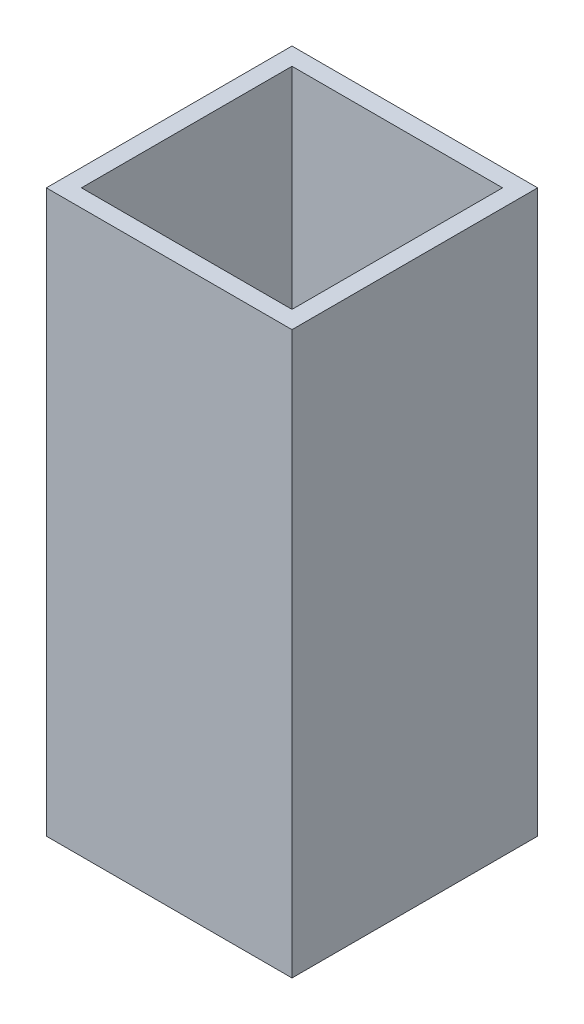
ISO-10303-21;
HEADER;
FILE_DESCRIPTION(('STEP AP214'),'2;1');
FILE_NAME('part.step','',(''),(''),'','','');
FILE_SCHEMA(('AUTOMOTIVE_DESIGN { 1 0 10303 214 1 1 1 1 }'));
ENDSEC;
DATA;
#1=APPLICATION_CONTEXT('core data for automotive mechanical design processes');
#2=APPLICATION_PROTOCOL_DEFINITION('international standard','automotive_design',2000,#1);
#3=PRODUCT_CONTEXT('',#1,'mechanical');
#4=PRODUCT('Part','Part','',(#3));
#5=PRODUCT_RELATED_PRODUCT_CATEGORY('part','',(#4));
#6=PRODUCT_DEFINITION_FORMATION('','',#4);
#7=PRODUCT_DEFINITION_CONTEXT('part definition',#1,'design');
#8=PRODUCT_DEFINITION('design','',#6,#7);
#9=PRODUCT_DEFINITION_SHAPE('','',#8);
#10=(LENGTH_UNIT() NAMED_UNIT(*) SI_UNIT(.MILLI.,.METRE.));
#11=(NAMED_UNIT(*) PLANE_ANGLE_UNIT() SI_UNIT($,.RADIAN.));
#12=(NAMED_UNIT(*) SI_UNIT($,.STERADIAN.) SOLID_ANGLE_UNIT());
#13=UNCERTAINTY_MEASURE_WITH_UNIT(LENGTH_MEASURE(1.E-05),#10,'distance_accuracy_value','');
#14=(GEOMETRIC_REPRESENTATION_CONTEXT(3) GLOBAL_UNCERTAINTY_ASSIGNED_CONTEXT((#13)) GLOBAL_UNIT_ASSIGNED_CONTEXT((#10,
#11,#12)) REPRESENTATION_CONTEXT('',''));
#15=CARTESIAN_POINT('',(0.,0.,0.));
#16=DIRECTION('',(0.,0.,1.));
#17=DIRECTION('',(1.,0.,0.));
#18=AXIS2_PLACEMENT_3D('',#15,#16,#17);
#19=CARTESIAN_POINT('',(0.,101.6,41.275));
#20=DIRECTION('',(0.,0.,1.));
#21=DIRECTION('',(1.,0.,0.));
#22=AXIS2_PLACEMENT_3D('',#19,#20,#21);
#23=PLANE('',#22);
#24=DIRECTION('',(0.,1.,0.));
#25=VECTOR('',#24,1.);
#26=CARTESIAN_POINT('',(663.575,101.6,41.275));
#27=LINE('',#26,#25);
#28=CARTESIAN_POINT('',(663.575,101.6,41.275));
#29=VERTEX_POINT('',#28);
#30=CARTESIAN_POINT('',(663.575,0.,41.275));
#31=VERTEX_POINT('',#30);
#32=EDGE_CURVE('E17',#29,#31,#27,.F.);
#33=ORIENTED_EDGE('',*,*,#32,.F.);
#34=DIRECTION('',(1.,0.,0.));
#35=VECTOR('',#34,1.);
#36=CARTESIAN_POINT('',(0.,101.6,41.275));
#37=LINE('',#36,#35);
#38=CARTESIAN_POINT('',(701.675,101.6,41.275));
#39=VERTEX_POINT('',#38);
#40=EDGE_CURVE('E103',#39,#29,#37,.F.);
#41=ORIENTED_EDGE('',*,*,#40,.F.);
#42=DIRECTION('',(0.,1.,0.));
#43=VECTOR('',#42,1.);
#44=CARTESIAN_POINT('',(701.675,101.6,41.275));
#45=LINE('',#44,#43);
#46=CARTESIAN_POINT('',(701.675,0.,41.275));
#47=VERTEX_POINT('',#46);
#48=EDGE_CURVE('E99',#47,#39,#45,.T.);
#49=ORIENTED_EDGE('',*,*,#48,.F.);
#50=DIRECTION('',(1.,0.,0.));
#51=VECTOR('',#50,1.);
#52=CARTESIAN_POINT('',(0.,0.,41.275));
#53=LINE('',#52,#51);
#54=EDGE_CURVE('E117',#47,#31,#53,.F.);
#55=ORIENTED_EDGE('',*,*,#54,.T.);
#56=EDGE_LOOP('',(#33,#41,#49,#55));
#57=FACE_BOUND('',#56,.T.);
#58=ADVANCED_FACE('F14',(#57),#23,.F.);
#59=CARTESIAN_POINT('',(663.575,101.6,22.225));
#60=DIRECTION('',(1.,0.,0.));
#61=DIRECTION('',(0.,0.,-1.));
#62=AXIS2_PLACEMENT_3D('',#59,#60,#61);
#63=PLANE('',#62);
#64=DIRECTION('',(0.,0.,1.));
#65=VECTOR('',#64,1.);
#66=CARTESIAN_POINT('',(663.575,101.6,22.225));
#67=LINE('',#66,#65);
#68=CARTESIAN_POINT('',(663.575,101.6,3.175));
#69=VERTEX_POINT('',#68);
#70=EDGE_CURVE('E87',#29,#69,#67,.F.);
#71=ORIENTED_EDGE('',*,*,#70,.F.);
#72=ORIENTED_EDGE('',*,*,#32,.T.);
#73=DIRECTION('',(0.,0.,1.));
#74=VECTOR('',#73,1.);
#75=CARTESIAN_POINT('',(663.575,0.,22.225));
#76=LINE('',#75,#74);
#77=CARTESIAN_POINT('',(663.575,0.,3.175));
#78=VERTEX_POINT('',#77);
#79=EDGE_CURVE('E112',#31,#78,#76,.F.);
#80=ORIENTED_EDGE('',*,*,#79,.T.);
#81=DIRECTION('',(0.,1.,0.));
#82=VECTOR('',#81,1.);
#83=CARTESIAN_POINT('',(663.575,101.6,3.175));
#84=LINE('',#83,#82);
#85=EDGE_CURVE('E75',#69,#78,#84,.F.);
#86=ORIENTED_EDGE('',*,*,#85,.F.);
#87=EDGE_LOOP('',(#71,#72,#80,#86));
#88=FACE_BOUND('',#87,.T.);
#89=ADVANCED_FACE('F111',(#88),#63,.T.);
#90=CARTESIAN_POINT('',(0.,101.6,3.175));
#91=DIRECTION('',(0.,0.,1.));
#92=DIRECTION('',(1.,0.,0.));
#93=AXIS2_PLACEMENT_3D('',#90,#91,#92);
#94=PLANE('',#93);
#95=DIRECTION('',(1.,0.,0.));
#96=VECTOR('',#95,1.);
#97=CARTESIAN_POINT('',(0.,101.6,3.175));
#98=LINE('',#97,#96);
#99=CARTESIAN_POINT('',(701.675,101.6,3.175));
#100=VERTEX_POINT('',#99);
#101=EDGE_CURVE('E81',#69,#100,#98,.T.);
#102=ORIENTED_EDGE('',*,*,#101,.F.);
#103=ORIENTED_EDGE('',*,*,#85,.T.);
#104=DIRECTION('',(1.,0.,0.));
#105=VECTOR('',#104,1.);
#106=CARTESIAN_POINT('',(0.,0.,3.175));
#107=LINE('',#106,#105);
#108=CARTESIAN_POINT('',(701.675,0.,3.175));
#109=VERTEX_POINT('',#108);
#110=EDGE_CURVE('E95',#78,#109,#107,.T.);
#111=ORIENTED_EDGE('',*,*,#110,.T.);
#112=DIRECTION('',(0.,1.,0.));
#113=VECTOR('',#112,1.);
#114=CARTESIAN_POINT('',(701.675,101.6,3.175));
#115=LINE('',#114,#113);
#116=EDGE_CURVE('E92',#100,#109,#115,.F.);
#117=ORIENTED_EDGE('',*,*,#116,.F.);
#118=EDGE_LOOP('',(#102,#103,#111,#117));
#119=FACE_BOUND('',#118,.T.);
#120=ADVANCED_FACE('F93',(#119),#94,.T.);
#121=CARTESIAN_POINT('',(701.675,101.6,44.45));
#122=DIRECTION('',(-1.,0.,0.));
#123=DIRECTION('',(0.,0.,1.));
#124=AXIS2_PLACEMENT_3D('',#121,#122,#123);
#125=PLANE('',#124);
#126=DIRECTION('',(0.,0.,1.));
#127=VECTOR('',#126,1.);
#128=CARTESIAN_POINT('',(701.675,101.6,22.225));
#129=LINE('',#128,#127);
#130=EDGE_CURVE('E85',#100,#39,#129,.T.);
#131=ORIENTED_EDGE('',*,*,#130,.F.);
#132=ORIENTED_EDGE('',*,*,#116,.T.);
#133=DIRECTION('',(0.,0.,1.));
#134=VECTOR('',#133,1.);
#135=CARTESIAN_POINT('',(701.675,0.,22.225));
#136=LINE('',#135,#134);
#137=EDGE_CURVE('E157',#109,#47,#136,.T.);
#138=ORIENTED_EDGE('',*,*,#137,.T.);
#139=ORIENTED_EDGE('',*,*,#48,.T.);
#140=EDGE_LOOP('',(#131,#132,#138,#139));
#141=FACE_BOUND('',#140,.T.);
#142=ADVANCED_FACE('F101',(#141),#125,.T.);
#143=CARTESIAN_POINT('',(660.4,101.6,22.225));
#144=DIRECTION('',(1.,0.,0.));
#145=DIRECTION('',(0.,0.,-1.));
#146=AXIS2_PLACEMENT_3D('',#143,#144,#145);
#147=PLANE('',#146);
#148=DIRECTION('',(0.,1.,0.));
#149=VECTOR('',#148,1.);
#150=CARTESIAN_POINT('',(660.4,101.6,44.45));
#151=LINE('',#150,#149);
#152=CARTESIAN_POINT('',(660.4,101.6,44.45));
#153=VERTEX_POINT('',#152);
#154=CARTESIAN_POINT('',(660.4,0.,44.45));
#155=VERTEX_POINT('',#154);
#156=EDGE_CURVE('E89',#153,#155,#151,.F.);
#157=ORIENTED_EDGE('',*,*,#156,.F.);
#158=DIRECTION('',(0.,0.,1.));
#159=VECTOR('',#158,1.);
#160=CARTESIAN_POINT('',(660.4,101.6,22.225));
#161=LINE('',#160,#159);
#162=CARTESIAN_POINT('',(660.4,101.6,0.));
#163=VERTEX_POINT('',#162);
#164=EDGE_CURVE('E130',#163,#153,#161,.T.);
#165=ORIENTED_EDGE('',*,*,#164,.F.);
#166=DIRECTION('',(0.,1.,0.));
#167=VECTOR('',#166,1.);
#168=CARTESIAN_POINT('',(660.4,101.6,0.));
#169=LINE('',#168,#167);
#170=CARTESIAN_POINT('',(660.4,0.,0.));
#171=VERTEX_POINT('',#170);
#172=EDGE_CURVE('E119',#163,#171,#169,.F.);
#173=ORIENTED_EDGE('',*,*,#172,.T.);
#174=DIRECTION('',(0.,0.,1.));
#175=VECTOR('',#174,1.);
#176=CARTESIAN_POINT('',(660.4,0.,22.225));
#177=LINE('',#176,#175);
#178=EDGE_CURVE('E140',#171,#155,#177,.T.);
#179=ORIENTED_EDGE('',*,*,#178,.T.);
#180=EDGE_LOOP('',(#157,#165,#173,#179));
#181=FACE_BOUND('',#180,.T.);
#182=ADVANCED_FACE('F139',(#181),#147,.F.);
#183=CARTESIAN_POINT('',(0.,101.6,44.45));
#184=DIRECTION('',(0.,0.,1.));
#185=DIRECTION('',(1.,0.,0.));
#186=AXIS2_PLACEMENT_3D('',#183,#184,#185);
#187=PLANE('',#186);
#188=DIRECTION('',(1.,0.,0.));
#189=VECTOR('',#188,1.);
#190=CARTESIAN_POINT('',(0.,101.6,44.45));
#191=LINE('',#190,#189);
#192=CARTESIAN_POINT('',(704.85,101.6,44.45));
#193=VERTEX_POINT('',#192);
#194=EDGE_CURVE('E128',#153,#193,#191,.T.);
#195=ORIENTED_EDGE('',*,*,#194,.F.);
#196=ORIENTED_EDGE('',*,*,#156,.T.);
#197=DIRECTION('',(1.,0.,0.));
#198=VECTOR('',#197,1.);
#199=CARTESIAN_POINT('',(0.,0.,44.45));
#200=LINE('',#199,#198);
#201=CARTESIAN_POINT('',(704.85,0.,44.45));
#202=VERTEX_POINT('',#201);
#203=EDGE_CURVE('E147',#155,#202,#200,.T.);
#204=ORIENTED_EDGE('',*,*,#203,.T.);
#205=DIRECTION('',(0.,1.,0.));
#206=VECTOR('',#205,1.);
#207=CARTESIAN_POINT('',(704.85,101.6,44.45));
#208=LINE('',#207,#206);
#209=EDGE_CURVE('E146',#202,#193,#208,.T.);
#210=ORIENTED_EDGE('',*,*,#209,.T.);
#211=EDGE_LOOP('',(#195,#196,#204,#210));
#212=FACE_BOUND('',#211,.T.);
#213=ADVANCED_FACE('F145',(#212),#187,.T.);
#214=CARTESIAN_POINT('',(0.,101.6,22.225));
#215=DIRECTION('',(0.,1.,0.));
#216=DIRECTION('',(0.,0.,1.));
#217=AXIS2_PLACEMENT_3D('',#214,#215,#216);
#218=PLANE('',#217);
#219=ORIENTED_EDGE('',*,*,#194,.T.);
#220=DIRECTION('',(0.,0.,1.));
#221=VECTOR('',#220,1.);
#222=CARTESIAN_POINT('',(704.85,101.6,44.45));
#223=LINE('',#222,#221);
#224=CARTESIAN_POINT('',(704.85,101.6,0.));
#225=VERTEX_POINT('',#224);
#226=EDGE_CURVE('E149',#193,#225,#223,.F.);
#227=ORIENTED_EDGE('',*,*,#226,.T.);
#228=DIRECTION('',(1.,0.,0.));
#229=VECTOR('',#228,1.);
#230=CARTESIAN_POINT('',(0.,101.6,0.));
#231=LINE('',#230,#229);
#232=EDGE_CURVE('E122',#225,#163,#231,.F.);
#233=ORIENTED_EDGE('',*,*,#232,.T.);
#234=ORIENTED_EDGE('',*,*,#164,.T.);
#235=EDGE_LOOP('',(#219,#227,#233,#234));
#236=FACE_BOUND('',#235,.T.);
#237=ORIENTED_EDGE('',*,*,#40,.T.);
#238=ORIENTED_EDGE('',*,*,#70,.T.);
#239=ORIENTED_EDGE('',*,*,#101,.T.);
#240=ORIENTED_EDGE('',*,*,#130,.T.);
#241=EDGE_LOOP('',(#237,#238,#239,#240));
#242=FACE_BOUND('',#241,.T.);
#243=ADVANCED_FACE('F83',(#236,#242),#218,.T.);
#244=CARTESIAN_POINT('',(0.,101.6,0.));
#245=DIRECTION('',(0.,0.,1.));
#246=DIRECTION('',(1.,0.,0.));
#247=AXIS2_PLACEMENT_3D('',#244,#245,#246);
#248=PLANE('',#247);
#249=ORIENTED_EDGE('',*,*,#172,.F.);
#250=ORIENTED_EDGE('',*,*,#232,.F.);
#251=DIRECTION('',(0.,1.,0.));
#252=VECTOR('',#251,1.);
#253=CARTESIAN_POINT('',(704.85,101.6,0.));
#254=LINE('',#253,#252);
#255=CARTESIAN_POINT('',(704.85,0.,0.));
#256=VERTEX_POINT('',#255);
#257=EDGE_CURVE('E23',#225,#256,#254,.F.);
#258=ORIENTED_EDGE('',*,*,#257,.T.);
#259=DIRECTION('',(1.,0.,0.));
#260=VECTOR('',#259,1.);
#261=CARTESIAN_POINT('',(0.,0.,0.));
#262=LINE('',#261,#260);
#263=EDGE_CURVE('E31',#256,#171,#262,.F.);
#264=ORIENTED_EDGE('',*,*,#263,.T.);
#265=EDGE_LOOP('',(#249,#250,#258,#264));
#266=FACE_BOUND('',#265,.T.);
#267=ADVANCED_FACE('F161',(#266),#248,.F.);
#268=CARTESIAN_POINT('',(0.,0.,22.225));
#269=DIRECTION('',(0.,1.,0.));
#270=DIRECTION('',(0.,0.,1.));
#271=AXIS2_PLACEMENT_3D('',#268,#269,#270);
#272=PLANE('',#271);
#273=DIRECTION('',(0.,0.,1.));
#274=VECTOR('',#273,1.);
#275=CARTESIAN_POINT('',(704.85,0.,44.45));
#276=LINE('',#275,#274);
#277=EDGE_CURVE('E9',#256,#202,#276,.T.);
#278=ORIENTED_EDGE('',*,*,#277,.T.);
#279=ORIENTED_EDGE('',*,*,#203,.F.);
#280=ORIENTED_EDGE('',*,*,#178,.F.);
#281=ORIENTED_EDGE('',*,*,#263,.F.);
#282=EDGE_LOOP('',(#278,#279,#280,#281));
#283=FACE_BOUND('',#282,.T.);
#284=ORIENTED_EDGE('',*,*,#110,.F.);
#285=ORIENTED_EDGE('',*,*,#79,.F.);
#286=ORIENTED_EDGE('',*,*,#54,.F.);
#287=ORIENTED_EDGE('',*,*,#137,.F.);
#288=EDGE_LOOP('',(#284,#285,#286,#287));
#289=FACE_BOUND('',#288,.T.);
#290=ADVANCED_FACE('F116',(#283,#289),#272,.F.);
#291=CARTESIAN_POINT('',(704.85,101.6,44.45));
#292=DIRECTION('',(-1.,0.,0.));
#293=DIRECTION('',(0.,0.,1.));
#294=AXIS2_PLACEMENT_3D('',#291,#292,#293);
#295=PLANE('',#294);
#296=ORIENTED_EDGE('',*,*,#257,.F.);
#297=ORIENTED_EDGE('',*,*,#226,.F.);
#298=ORIENTED_EDGE('',*,*,#209,.F.);
#299=ORIENTED_EDGE('',*,*,#277,.F.);
#300=EDGE_LOOP('',(#296,#297,#298,#299));
#301=FACE_BOUND('',#300,.T.);
#302=ADVANCED_FACE('F162',(#301),#295,.F.);
#303=CLOSED_SHELL('',(#58,#89,#120,#142,#182,#213,#243,#267,#290,#302));
#304=MANIFOLD_SOLID_BREP('B1',#303);
#305=ADVANCED_BREP_SHAPE_REPRESENTATION('',(#18,#304),#14);
#306=SHAPE_DEFINITION_REPRESENTATION(#9,#305);
ENDSEC;
END-ISO-10303-21;
